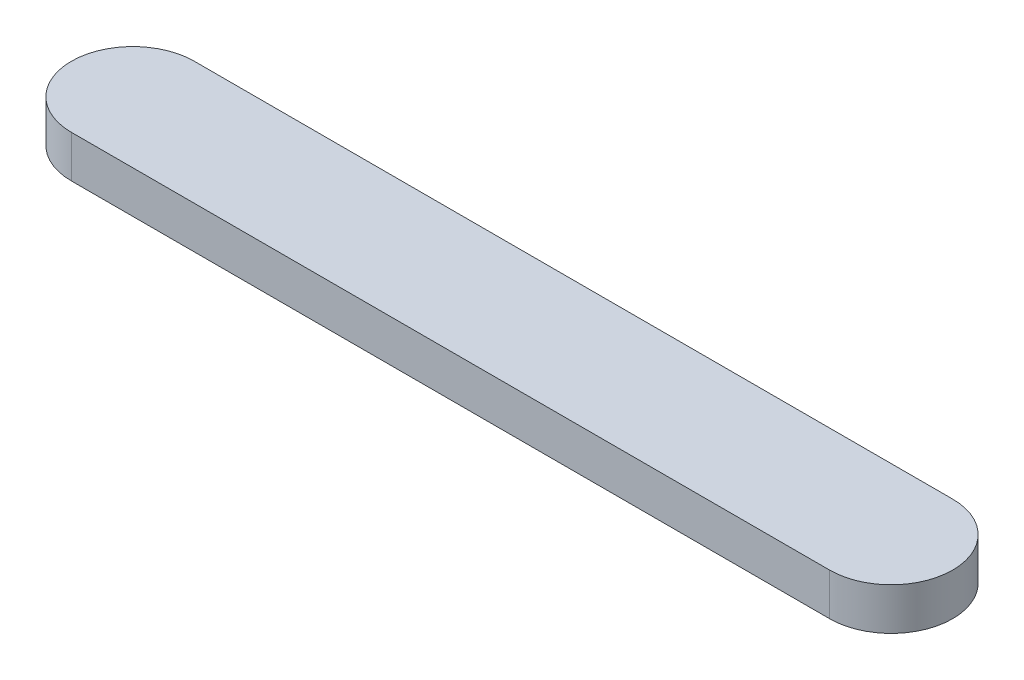
ISO-10303-21;
HEADER;
FILE_DESCRIPTION(('STEP AP214'),'2;1');
FILE_NAME('part.step','',(''),(''),'','','');
FILE_SCHEMA(('AUTOMOTIVE_DESIGN { 1 0 10303 214 1 1 1 1 }'));
ENDSEC;
DATA;
#1=APPLICATION_CONTEXT('core data for automotive mechanical design processes');
#2=APPLICATION_PROTOCOL_DEFINITION('international standard','automotive_design',2000,#1);
#3=PRODUCT_CONTEXT('',#1,'mechanical');
#4=PRODUCT('Part','Part','',(#3));
#5=PRODUCT_RELATED_PRODUCT_CATEGORY('part','',(#4));
#6=PRODUCT_DEFINITION_FORMATION('','',#4);
#7=PRODUCT_DEFINITION_CONTEXT('part definition',#1,'design');
#8=PRODUCT_DEFINITION('design','',#6,#7);
#9=PRODUCT_DEFINITION_SHAPE('','',#8);
#10=(LENGTH_UNIT() NAMED_UNIT(*) SI_UNIT(.MILLI.,.METRE.));
#11=(NAMED_UNIT(*) PLANE_ANGLE_UNIT() SI_UNIT($,.RADIAN.));
#12=(NAMED_UNIT(*) SI_UNIT($,.STERADIAN.) SOLID_ANGLE_UNIT());
#13=UNCERTAINTY_MEASURE_WITH_UNIT(LENGTH_MEASURE(1.E-05),#10,'distance_accuracy_value','');
#14=(GEOMETRIC_REPRESENTATION_CONTEXT(3) GLOBAL_UNCERTAINTY_ASSIGNED_CONTEXT((#13)) GLOBAL_UNIT_ASSIGNED_CONTEXT((#10,
#11,#12)) REPRESENTATION_CONTEXT('',''));
#15=CARTESIAN_POINT('',(0.,0.,0.));
#16=DIRECTION('',(0.,0.,1.));
#17=DIRECTION('',(1.,0.,0.));
#18=AXIS2_PLACEMENT_3D('',#15,#16,#17);
#19=CARTESIAN_POINT('',(0.,5.,0.));
#20=DIRECTION('',(0.,-1.,0.));
#21=DIRECTION('',(0.,0.,-1.));
#22=AXIS2_PLACEMENT_3D('',#19,#20,#21);
#23=CYLINDRICAL_SURFACE('',#22,7.3);
#24=CARTESIAN_POINT('',(0.,0.,0.));
#25=DIRECTION('',(0.,1.,0.));
#26=DIRECTION('',(0.,0.,1.));
#27=AXIS2_PLACEMENT_3D('',#24,#25,#26);
#28=CIRCLE('',#27,7.3);
#29=CARTESIAN_POINT('',(0.,0.,-7.3));
#30=VERTEX_POINT('',#29);
#31=CARTESIAN_POINT('',(0.,0.,7.3));
#32=VERTEX_POINT('',#31);
#33=EDGE_CURVE('E102',#30,#32,#28,.T.);
#34=ORIENTED_EDGE('',*,*,#33,.T.);
#35=DIRECTION('',(0.,-1.,0.));
#36=VECTOR('',#35,1.);
#37=CARTESIAN_POINT('',(0.,5.,7.3));
#38=LINE('',#37,#36);
#39=CARTESIAN_POINT('',(0.,5.,7.3));
#40=VERTEX_POINT('',#39);
#41=EDGE_CURVE('E11',#40,#32,#38,.T.);
#42=ORIENTED_EDGE('',*,*,#41,.F.);
#43=CARTESIAN_POINT('',(0.,5.,0.));
#44=DIRECTION('',(0.,1.,0.));
#45=DIRECTION('',(0.,0.,1.));
#46=AXIS2_PLACEMENT_3D('',#43,#44,#45);
#47=CIRCLE('',#46,7.3);
#48=CARTESIAN_POINT('',(0.,5.,-7.3));
#49=VERTEX_POINT('',#48);
#50=EDGE_CURVE('E90',#49,#40,#47,.T.);
#51=ORIENTED_EDGE('',*,*,#50,.F.);
#52=DIRECTION('',(0.,-1.,0.));
#53=VECTOR('',#52,1.);
#54=CARTESIAN_POINT('',(0.,5.,-7.3));
#55=LINE('',#54,#53);
#56=EDGE_CURVE('E98',#49,#30,#55,.T.);
#57=ORIENTED_EDGE('',*,*,#56,.T.);
#58=EDGE_LOOP('',(#34,#42,#51,#57));
#59=FACE_BOUND('',#58,.T.);
#60=ADVANCED_FACE('F39',(#59),#23,.T.);
#61=CARTESIAN_POINT('',(0.,5.,7.3));
#62=DIRECTION('',(0.,0.,-1.));
#63=DIRECTION('',(-1.,0.,0.));
#64=AXIS2_PLACEMENT_3D('',#61,#62,#63);
#65=PLANE('',#64);
#66=DIRECTION('',(1.,0.,0.));
#67=VECTOR('',#66,1.);
#68=CARTESIAN_POINT('',(0.,0.,7.3));
#69=LINE('',#68,#67);
#70=CARTESIAN_POINT('',(90.,0.,7.3));
#71=VERTEX_POINT('',#70);
#72=EDGE_CURVE('E94',#32,#71,#69,.T.);
#73=ORIENTED_EDGE('',*,*,#72,.T.);
#74=DIRECTION('',(0.,-1.,0.));
#75=VECTOR('',#74,1.);
#76=CARTESIAN_POINT('',(90.,5.,7.3));
#77=LINE('',#76,#75);
#78=CARTESIAN_POINT('',(90.,5.,7.3));
#79=VERTEX_POINT('',#78);
#80=EDGE_CURVE('E47',#79,#71,#77,.T.);
#81=ORIENTED_EDGE('',*,*,#80,.F.);
#82=DIRECTION('',(1.,0.,0.));
#83=VECTOR('',#82,1.);
#84=CARTESIAN_POINT('',(0.,5.,7.3));
#85=LINE('',#84,#83);
#86=EDGE_CURVE('E85',#40,#79,#85,.T.);
#87=ORIENTED_EDGE('',*,*,#86,.F.);
#88=ORIENTED_EDGE('',*,*,#41,.T.);
#89=EDGE_LOOP('',(#73,#81,#87,#88));
#90=FACE_BOUND('',#89,.T.);
#91=ADVANCED_FACE('F93',(#90),#65,.F.);
#92=CARTESIAN_POINT('',(90.,5.,0.));
#93=DIRECTION('',(0.,-1.,0.));
#94=DIRECTION('',(0.,0.,-1.));
#95=AXIS2_PLACEMENT_3D('',#92,#93,#94);
#96=CYLINDRICAL_SURFACE('',#95,7.3);
#97=CARTESIAN_POINT('',(90.,0.,0.));
#98=DIRECTION('',(0.,1.,0.));
#99=DIRECTION('',(0.,0.,1.));
#100=AXIS2_PLACEMENT_3D('',#97,#98,#99);
#101=CIRCLE('',#100,7.3);
#102=CARTESIAN_POINT('',(90.,0.,-7.3));
#103=VERTEX_POINT('',#102);
#104=EDGE_CURVE('E72',#71,#103,#101,.T.);
#105=ORIENTED_EDGE('',*,*,#104,.T.);
#106=DIRECTION('',(0.,-1.,0.));
#107=VECTOR('',#106,1.);
#108=CARTESIAN_POINT('',(90.,5.,-7.3));
#109=LINE('',#108,#107);
#110=CARTESIAN_POINT('',(90.,5.,-7.3));
#111=VERTEX_POINT('',#110);
#112=EDGE_CURVE('E95',#111,#103,#109,.T.);
#113=ORIENTED_EDGE('',*,*,#112,.F.);
#114=CARTESIAN_POINT('',(90.,5.,0.));
#115=DIRECTION('',(0.,1.,0.));
#116=DIRECTION('',(0.,0.,1.));
#117=AXIS2_PLACEMENT_3D('',#114,#115,#116);
#118=CIRCLE('',#117,7.3);
#119=EDGE_CURVE('E88',#79,#111,#118,.T.);
#120=ORIENTED_EDGE('',*,*,#119,.F.);
#121=ORIENTED_EDGE('',*,*,#80,.T.);
#122=EDGE_LOOP('',(#105,#113,#120,#121));
#123=FACE_BOUND('',#122,.T.);
#124=ADVANCED_FACE('F96',(#123),#96,.T.);
#125=CARTESIAN_POINT('',(0.,5.,-7.3));
#126=DIRECTION('',(0.,0.,1.));
#127=DIRECTION('',(1.,0.,0.));
#128=AXIS2_PLACEMENT_3D('',#125,#126,#127);
#129=PLANE('',#128);
#130=DIRECTION('',(-1.,0.,0.));
#131=VECTOR('',#130,1.);
#132=CARTESIAN_POINT('',(0.,0.,-7.3));
#133=LINE('',#132,#131);
#134=EDGE_CURVE('E78',#103,#30,#133,.T.);
#135=ORIENTED_EDGE('',*,*,#134,.T.);
#136=ORIENTED_EDGE('',*,*,#56,.F.);
#137=DIRECTION('',(-1.,0.,0.));
#138=VECTOR('',#137,1.);
#139=CARTESIAN_POINT('',(0.,5.,-7.3));
#140=LINE('',#139,#138);
#141=EDGE_CURVE('E55',#111,#49,#140,.T.);
#142=ORIENTED_EDGE('',*,*,#141,.F.);
#143=ORIENTED_EDGE('',*,*,#112,.T.);
#144=EDGE_LOOP('',(#135,#136,#142,#143));
#145=FACE_BOUND('',#144,.T.);
#146=ADVANCED_FACE('F109',(#145),#129,.F.);
#147=CARTESIAN_POINT('',(0.,5.,0.));
#148=DIRECTION('',(0.,1.,0.));
#149=DIRECTION('',(0.,0.,1.));
#150=AXIS2_PLACEMENT_3D('',#147,#148,#149);
#151=PLANE('',#150);
#152=ORIENTED_EDGE('',*,*,#50,.T.);
#153=ORIENTED_EDGE('',*,*,#86,.T.);
#154=ORIENTED_EDGE('',*,*,#119,.T.);
#155=ORIENTED_EDGE('',*,*,#141,.T.);
#156=EDGE_LOOP('',(#152,#153,#154,#155));
#157=FACE_BOUND('',#156,.T.);
#158=ADVANCED_FACE('F86',(#157),#151,.T.);
#159=CARTESIAN_POINT('',(0.,0.,0.));
#160=DIRECTION('',(0.,1.,0.));
#161=DIRECTION('',(0.,0.,1.));
#162=AXIS2_PLACEMENT_3D('',#159,#160,#161);
#163=PLANE('',#162);
#164=ORIENTED_EDGE('',*,*,#33,.F.);
#165=ORIENTED_EDGE('',*,*,#134,.F.);
#166=ORIENTED_EDGE('',*,*,#104,.F.);
#167=ORIENTED_EDGE('',*,*,#72,.F.);
#168=EDGE_LOOP('',(#164,#165,#166,#167));
#169=FACE_BOUND('',#168,.T.);
#170=ADVANCED_FACE('F112',(#169),#163,.F.);
#171=CLOSED_SHELL('',(#60,#91,#124,#146,#158,#170));
#172=MANIFOLD_SOLID_BREP('B2',#171);
#173=ADVANCED_BREP_SHAPE_REPRESENTATION('',(#18,#172),#14);
#174=SHAPE_DEFINITION_REPRESENTATION(#9,#173);
ENDSEC;
END-ISO-10303-21;
